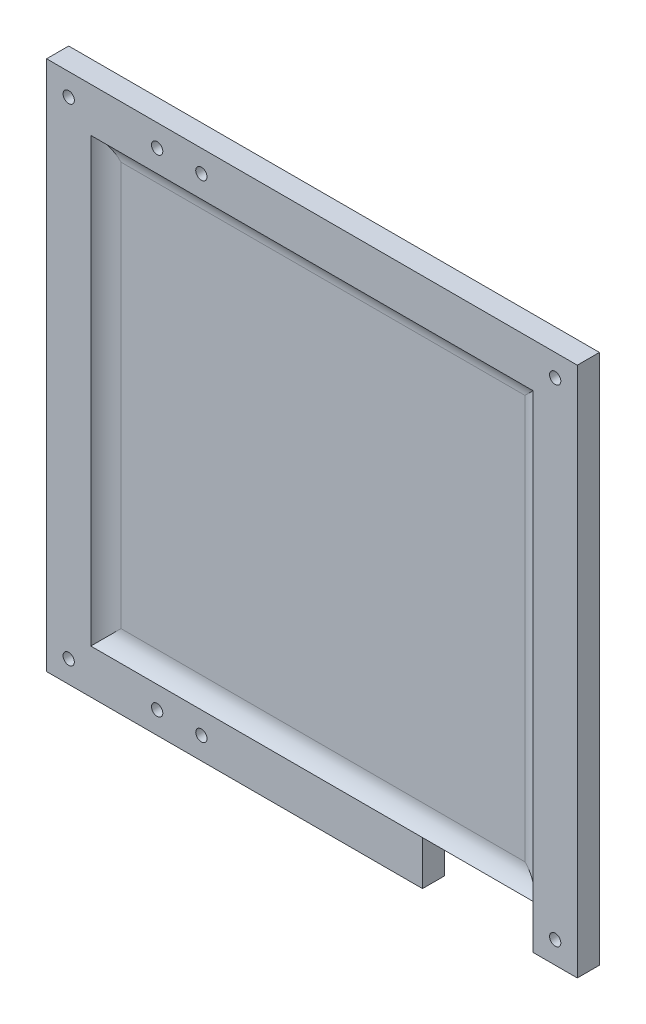
ISO-10303-21;
HEADER;
FILE_DESCRIPTION(('STEP AP214'),'2;1');
FILE_NAME('part.step','',(''),(''),'','','');
FILE_SCHEMA(('AUTOMOTIVE_DESIGN { 1 0 10303 214 1 1 1 1 }'));
ENDSEC;
DATA;
#1=APPLICATION_CONTEXT('core data for automotive mechanical design processes');
#2=APPLICATION_PROTOCOL_DEFINITION('international standard','automotive_design',2000,#1);
#3=PRODUCT_CONTEXT('',#1,'mechanical');
#4=PRODUCT('Part','Part','',(#3));
#5=PRODUCT_RELATED_PRODUCT_CATEGORY('part','',(#4));
#6=PRODUCT_DEFINITION_FORMATION('','',#4);
#7=PRODUCT_DEFINITION_CONTEXT('part definition',#1,'design');
#8=PRODUCT_DEFINITION('design','',#6,#7);
#9=PRODUCT_DEFINITION_SHAPE('','',#8);
#10=(LENGTH_UNIT() NAMED_UNIT(*) SI_UNIT(.MILLI.,.METRE.));
#11=(NAMED_UNIT(*) PLANE_ANGLE_UNIT() SI_UNIT($,.RADIAN.));
#12=(NAMED_UNIT(*) SI_UNIT($,.STERADIAN.) SOLID_ANGLE_UNIT());
#13=UNCERTAINTY_MEASURE_WITH_UNIT(LENGTH_MEASURE(1.E-05),#10,'distance_accuracy_value','');
#14=(GEOMETRIC_REPRESENTATION_CONTEXT(3) GLOBAL_UNCERTAINTY_ASSIGNED_CONTEXT((#13)) GLOBAL_UNIT_ASSIGNED_CONTEXT((#10,
#11,#12)) REPRESENTATION_CONTEXT('',''));
#15=CARTESIAN_POINT('',(0.,0.,0.));
#16=DIRECTION('',(0.,0.,1.));
#17=DIRECTION('',(1.,0.,0.));
#18=AXIS2_PLACEMENT_3D('',#15,#16,#17);
#19=CARTESIAN_POINT('',(-120.,-120.,10.));
#20=DIRECTION('',(0.,1.,0.));
#21=DIRECTION('',(0.,0.,1.));
#22=AXIS2_PLACEMENT_3D('',#19,#20,#21);
#23=PLANE('',#22);
#24=DIRECTION('',(1.,0.,0.));
#25=VECTOR('',#24,1.);
#26=CARTESIAN_POINT('',(-120.,-120.,0.));
#27=LINE('',#26,#25);
#28=CARTESIAN_POINT('',(-120.,-120.,0.));
#29=VERTEX_POINT('',#28);
#30=CARTESIAN_POINT('',(49.9999999999999,-120.,0.));
#31=VERTEX_POINT('',#30);
#32=EDGE_CURVE('E145',#29,#31,#27,.T.);
#33=ORIENTED_EDGE('',*,*,#32,.T.);
#34=DIRECTION('',(0.,0.,1.));
#35=VECTOR('',#34,1.);
#36=CARTESIAN_POINT('',(49.9999999999999,-120.,-140.));
#37=LINE('',#36,#35);
#38=CARTESIAN_POINT('',(49.9999999999999,-120.,10.));
#39=VERTEX_POINT('',#38);
#40=EDGE_CURVE('E128',#31,#39,#37,.T.);
#41=ORIENTED_EDGE('',*,*,#40,.T.);
#42=DIRECTION('',(1.,0.,0.));
#43=VECTOR('',#42,1.);
#44=CARTESIAN_POINT('',(-120.,-120.,10.));
#45=LINE('',#44,#43);
#46=CARTESIAN_POINT('',(-120.,-120.,10.));
#47=VERTEX_POINT('',#46);
#48=EDGE_CURVE('E143',#47,#39,#45,.T.);
#49=ORIENTED_EDGE('',*,*,#48,.F.);
#50=DIRECTION('',(0.,0.,-1.));
#51=VECTOR('',#50,1.);
#52=CARTESIAN_POINT('',(-120.,-120.,10.));
#53=LINE('',#52,#51);
#54=EDGE_CURVE('E162',#47,#29,#53,.T.);
#55=ORIENTED_EDGE('',*,*,#54,.T.);
#56=EDGE_LOOP('',(#33,#41,#49,#55));
#57=FACE_BOUND('',#56,.T.);
#58=ADVANCED_FACE('F39',(#57),#23,.F.);
#59=CARTESIAN_POINT('',(0.,0.,10.));
#60=DIRECTION('',(0.,0.,-1.));
#61=DIRECTION('',(-1.,0.,0.));
#62=AXIS2_PLACEMENT_3D('',#59,#60,#61);
#63=PLANE('',#62);
#64=ORIENTED_EDGE('',*,*,#48,.T.);
#65=DIRECTION('',(0.,-1.,0.));
#66=VECTOR('',#65,1.);
#67=CARTESIAN_POINT('',(49.9999999999999,-120.,10.));
#68=LINE('',#67,#66);
#69=CARTESIAN_POINT('',(49.9999999999999,-100.,10.));
#70=VERTEX_POINT('',#69);
#71=EDGE_CURVE('E125',#70,#39,#68,.T.);
#72=ORIENTED_EDGE('',*,*,#71,.F.);
#73=DIRECTION('',(1.,0.,0.));
#74=VECTOR('',#73,1.);
#75=CARTESIAN_POINT('',(-99.9999999999999,-100.,10.));
#76=LINE('',#75,#74);
#77=CARTESIAN_POINT('',(-99.9999999999999,-100.,10.));
#78=VERTEX_POINT('',#77);
#79=EDGE_CURVE('E215',#78,#70,#76,.T.);
#80=ORIENTED_EDGE('',*,*,#79,.F.);
#81=DIRECTION('',(0.,-1.,0.));
#82=VECTOR('',#81,1.);
#83=CARTESIAN_POINT('',(-100.,99.9999999999999,10.));
#84=LINE('',#83,#82);
#85=CARTESIAN_POINT('',(-100.,99.9999999999999,10.));
#86=VERTEX_POINT('',#85);
#87=EDGE_CURVE('E230',#86,#78,#84,.T.);
#88=ORIENTED_EDGE('',*,*,#87,.F.);
#89=DIRECTION('',(-1.,0.,0.));
#90=VECTOR('',#89,1.);
#91=CARTESIAN_POINT('',(100.,99.9999999999999,10.));
#92=LINE('',#91,#90);
#93=CARTESIAN_POINT('',(100.,99.9999999999999,10.));
#94=VERTEX_POINT('',#93);
#95=EDGE_CURVE('E223',#94,#86,#92,.T.);
#96=ORIENTED_EDGE('',*,*,#95,.F.);
#97=DIRECTION('',(0.,1.,0.));
#98=VECTOR('',#97,1.);
#99=CARTESIAN_POINT('',(99.9999999999999,-100.,10.));
#100=LINE('',#99,#98);
#101=CARTESIAN_POINT('',(99.9999999999999,-100.,10.));
#102=VERTEX_POINT('',#101);
#103=EDGE_CURVE('E218',#102,#94,#100,.T.);
#104=ORIENTED_EDGE('',*,*,#103,.F.);
#105=DIRECTION('',(0.,1.,0.));
#106=VECTOR('',#105,1.);
#107=CARTESIAN_POINT('',(99.9999999999999,-120.,10.));
#108=LINE('',#107,#106);
#109=CARTESIAN_POINT('',(99.9999999999999,-120.,10.));
#110=VERTEX_POINT('',#109);
#111=EDGE_CURVE('E137',#110,#102,#108,.T.);
#112=ORIENTED_EDGE('',*,*,#111,.F.);
#113=CARTESIAN_POINT('',(120.,-120.,10.));
#114=VERTEX_POINT('',#113);
#115=EDGE_CURVE('E157',#110,#114,#45,.T.);
#116=ORIENTED_EDGE('',*,*,#115,.T.);
#117=DIRECTION('',(0.,1.,0.));
#118=VECTOR('',#117,1.);
#119=CARTESIAN_POINT('',(120.,-120.,10.));
#120=LINE('',#119,#118);
#121=CARTESIAN_POINT('',(120.,120.,10.));
#122=VERTEX_POINT('',#121);
#123=EDGE_CURVE('E180',#114,#122,#120,.T.);
#124=ORIENTED_EDGE('',*,*,#123,.T.);
#125=DIRECTION('',(-1.,0.,0.));
#126=VECTOR('',#125,1.);
#127=CARTESIAN_POINT('',(-120.,120.,10.));
#128=LINE('',#127,#126);
#129=CARTESIAN_POINT('',(-120.,120.,10.));
#130=VERTEX_POINT('',#129);
#131=EDGE_CURVE('E299',#122,#130,#128,.T.);
#132=ORIENTED_EDGE('',*,*,#131,.T.);
#133=DIRECTION('',(0.,-1.,0.));
#134=VECTOR('',#133,1.);
#135=CARTESIAN_POINT('',(-120.,-120.,10.));
#136=LINE('',#135,#134);
#137=EDGE_CURVE('E153',#130,#47,#136,.T.);
#138=ORIENTED_EDGE('',*,*,#137,.T.);
#139=EDGE_LOOP('',(#64,#72,#80,#88,#96,#104,#112,#116,#124,#132,#138));
#140=FACE_BOUND('',#139,.T.);
#141=CARTESIAN_POINT('',(-110.,110.,10.));
#142=DIRECTION('',(0.,0.,1.));
#143=DIRECTION('',(1.,0.,0.));
#144=AXIS2_PLACEMENT_3D('',#141,#142,#143);
#145=CIRCLE('',#144,2.54999999999999);
#146=CARTESIAN_POINT('',(-107.45,110.,10.));
#147=VERTEX_POINT('',#146);
#148=EDGE_CURVE('E172',#147,#147,#145,.T.);
#149=ORIENTED_EDGE('',*,*,#148,.F.);
#150=EDGE_LOOP('',(#149));
#151=FACE_BOUND('',#150,.T.);
#152=CARTESIAN_POINT('',(110.,110.,10.));
#153=DIRECTION('',(0.,0.,1.));
#154=DIRECTION('',(-1.,0.,0.));
#155=AXIS2_PLACEMENT_3D('',#152,#153,#154);
#156=CIRCLE('',#155,2.54999999999999);
#157=CARTESIAN_POINT('',(107.45,110.,10.));
#158=VERTEX_POINT('',#157);
#159=EDGE_CURVE('E283',#158,#158,#156,.T.);
#160=ORIENTED_EDGE('',*,*,#159,.F.);
#161=EDGE_LOOP('',(#160));
#162=FACE_BOUND('',#161,.T.);
#163=CARTESIAN_POINT('',(110.,-110.,10.));
#164=DIRECTION('',(0.,0.,1.));
#165=DIRECTION('',(1.,0.,0.));
#166=AXIS2_PLACEMENT_3D('',#163,#164,#165);
#167=CIRCLE('',#166,2.54999999999999);
#168=CARTESIAN_POINT('',(112.55,-110.,10.));
#169=VERTEX_POINT('',#168);
#170=EDGE_CURVE('E275',#169,#169,#167,.T.);
#171=ORIENTED_EDGE('',*,*,#170,.F.);
#172=EDGE_LOOP('',(#171));
#173=FACE_BOUND('',#172,.T.);
#174=CARTESIAN_POINT('',(-110.,-110.,10.));
#175=DIRECTION('',(0.,0.,1.));
#176=DIRECTION('',(-1.,0.,0.));
#177=AXIS2_PLACEMENT_3D('',#174,#175,#176);
#178=CIRCLE('',#177,2.54999999999999);
#179=CARTESIAN_POINT('',(-112.55,-110.,10.));
#180=VERTEX_POINT('',#179);
#181=EDGE_CURVE('E267',#180,#180,#178,.T.);
#182=ORIENTED_EDGE('',*,*,#181,.F.);
#183=EDGE_LOOP('',(#182));
#184=FACE_BOUND('',#183,.T.);
#185=CARTESIAN_POINT('',(-69.9999999999999,110.,10.));
#186=DIRECTION('',(0.,0.,1.));
#187=DIRECTION('',(1.,0.,0.));
#188=AXIS2_PLACEMENT_3D('',#185,#186,#187);
#189=CIRCLE('',#188,2.54999999999999);
#190=CARTESIAN_POINT('',(-67.4499999999999,110.,10.));
#191=VERTEX_POINT('',#190);
#192=EDGE_CURVE('E259',#191,#191,#189,.T.);
#193=ORIENTED_EDGE('',*,*,#192,.F.);
#194=EDGE_LOOP('',(#193));
#195=FACE_BOUND('',#194,.T.);
#196=CARTESIAN_POINT('',(-69.9999999999999,-110.,10.));
#197=DIRECTION('',(0.,0.,1.));
#198=DIRECTION('',(-1.,0.,0.));
#199=AXIS2_PLACEMENT_3D('',#196,#197,#198);
#200=CIRCLE('',#199,2.54999999999999);
#201=CARTESIAN_POINT('',(-72.5499999999999,-110.,10.));
#202=VERTEX_POINT('',#201);
#203=EDGE_CURVE('E251',#202,#202,#200,.T.);
#204=ORIENTED_EDGE('',*,*,#203,.F.);
#205=EDGE_LOOP('',(#204));
#206=FACE_BOUND('',#205,.T.);
#207=CARTESIAN_POINT('',(-49.9999999999999,110.,10.));
#208=DIRECTION('',(0.,0.,1.));
#209=DIRECTION('',(1.,0.,0.));
#210=AXIS2_PLACEMENT_3D('',#207,#208,#209);
#211=CIRCLE('',#210,2.55);
#212=CARTESIAN_POINT('',(-47.4499999999999,110.,10.));
#213=VERTEX_POINT('',#212);
#214=EDGE_CURVE('E243',#213,#213,#211,.T.);
#215=ORIENTED_EDGE('',*,*,#214,.F.);
#216=EDGE_LOOP('',(#215));
#217=FACE_BOUND('',#216,.T.);
#218=CARTESIAN_POINT('',(-49.9999999999999,-110.,10.));
#219=DIRECTION('',(0.,0.,1.));
#220=DIRECTION('',(-1.,0.,0.));
#221=AXIS2_PLACEMENT_3D('',#218,#219,#220);
#222=CIRCLE('',#221,2.55);
#223=CARTESIAN_POINT('',(-52.5499999999999,-110.,10.));
#224=VERTEX_POINT('',#223);
#225=EDGE_CURVE('E235',#224,#224,#222,.T.);
#226=ORIENTED_EDGE('',*,*,#225,.F.);
#227=EDGE_LOOP('',(#226));
#228=FACE_BOUND('',#227,.T.);
#229=ADVANCED_FACE('F150',(#140,#151,#162,#173,#184,#195,#206,#217,#228),#63,.F.);
#230=CARTESIAN_POINT('',(0.,0.,0.));
#231=DIRECTION('',(0.,0.,-1.));
#232=DIRECTION('',(-1.,0.,0.));
#233=AXIS2_PLACEMENT_3D('',#230,#231,#232);
#234=PLANE('',#233);
#235=DIRECTION('',(0.,1.,0.));
#236=VECTOR('',#235,1.);
#237=CARTESIAN_POINT('',(49.9999999999999,0.,0.));
#238=LINE('',#237,#236);
#239=CARTESIAN_POINT('',(49.9999999999999,-100.,0.));
#240=VERTEX_POINT('',#239);
#241=EDGE_CURVE('E203',#31,#240,#238,.T.);
#242=ORIENTED_EDGE('',*,*,#241,.F.);
#243=ORIENTED_EDGE('',*,*,#32,.F.);
#244=DIRECTION('',(0.,-1.,0.));
#245=VECTOR('',#244,1.);
#246=CARTESIAN_POINT('',(-120.,-120.,0.));
#247=LINE('',#246,#245);
#248=CARTESIAN_POINT('',(-120.,120.,0.));
#249=VERTEX_POINT('',#248);
#250=EDGE_CURVE('E175',#249,#29,#247,.T.);
#251=ORIENTED_EDGE('',*,*,#250,.F.);
#252=DIRECTION('',(-1.,0.,0.));
#253=VECTOR('',#252,1.);
#254=CARTESIAN_POINT('',(-120.,120.,0.));
#255=LINE('',#254,#253);
#256=CARTESIAN_POINT('',(120.,120.,0.));
#257=VERTEX_POINT('',#256);
#258=EDGE_CURVE('E171',#257,#249,#255,.T.);
#259=ORIENTED_EDGE('',*,*,#258,.F.);
#260=DIRECTION('',(0.,1.,0.));
#261=VECTOR('',#260,1.);
#262=CARTESIAN_POINT('',(120.,-120.,0.));
#263=LINE('',#262,#261);
#264=CARTESIAN_POINT('',(120.,-120.,0.));
#265=VERTEX_POINT('',#264);
#266=EDGE_CURVE('E167',#265,#257,#263,.T.);
#267=ORIENTED_EDGE('',*,*,#266,.F.);
#268=CARTESIAN_POINT('',(99.9999999999999,-120.,0.));
#269=VERTEX_POINT('',#268);
#270=EDGE_CURVE('E178',#269,#265,#27,.T.);
#271=ORIENTED_EDGE('',*,*,#270,.F.);
#272=DIRECTION('',(0.,-1.,0.));
#273=VECTOR('',#272,1.);
#274=CARTESIAN_POINT('',(99.9999999999999,0.,0.));
#275=LINE('',#274,#273);
#276=CARTESIAN_POINT('',(99.9999999999999,-100.,0.));
#277=VERTEX_POINT('',#276);
#278=EDGE_CURVE('E317',#277,#269,#275,.T.);
#279=ORIENTED_EDGE('',*,*,#278,.F.);
#280=DIRECTION('',(1.,0.,0.));
#281=VECTOR('',#280,1.);
#282=CARTESIAN_POINT('',(0.,-100.,0.));
#283=LINE('',#282,#281);
#284=EDGE_CURVE('E315',#240,#277,#283,.T.);
#285=ORIENTED_EDGE('',*,*,#284,.F.);
#286=EDGE_LOOP('',(#242,#243,#251,#259,#267,#271,#279,#285));
#287=FACE_BOUND('',#286,.T.);
#288=CARTESIAN_POINT('',(-49.9999999999999,110.,0.));
#289=DIRECTION('',(0.,0.,1.));
#290=DIRECTION('',(1.,0.,0.));
#291=AXIS2_PLACEMENT_3D('',#288,#289,#290);
#292=CIRCLE('',#291,2.55);
#293=CARTESIAN_POINT('',(-47.4499999999999,110.,0.));
#294=VERTEX_POINT('',#293);
#295=EDGE_CURVE('E239',#294,#294,#292,.T.);
#296=ORIENTED_EDGE('',*,*,#295,.T.);
#297=EDGE_LOOP('',(#296));
#298=FACE_BOUND('',#297,.T.);
#299=CARTESIAN_POINT('',(-69.9999999999999,110.,0.));
#300=DIRECTION('',(0.,0.,1.));
#301=DIRECTION('',(1.,0.,0.));
#302=AXIS2_PLACEMENT_3D('',#299,#300,#301);
#303=CIRCLE('',#302,2.54999999999999);
#304=CARTESIAN_POINT('',(-67.4499999999999,110.,0.));
#305=VERTEX_POINT('',#304);
#306=EDGE_CURVE('E255',#305,#305,#303,.T.);
#307=ORIENTED_EDGE('',*,*,#306,.T.);
#308=EDGE_LOOP('',(#307));
#309=FACE_BOUND('',#308,.T.);
#310=CARTESIAN_POINT('',(110.,-110.,0.));
#311=DIRECTION('',(0.,0.,1.));
#312=DIRECTION('',(1.,0.,0.));
#313=AXIS2_PLACEMENT_3D('',#310,#311,#312);
#314=CIRCLE('',#313,2.54999999999999);
#315=CARTESIAN_POINT('',(112.55,-110.,0.));
#316=VERTEX_POINT('',#315);
#317=EDGE_CURVE('E271',#316,#316,#314,.T.);
#318=ORIENTED_EDGE('',*,*,#317,.T.);
#319=EDGE_LOOP('',(#318));
#320=FACE_BOUND('',#319,.T.);
#321=CARTESIAN_POINT('',(-110.,110.,0.));
#322=DIRECTION('',(0.,0.,1.));
#323=DIRECTION('',(1.,0.,0.));
#324=AXIS2_PLACEMENT_3D('',#321,#322,#323);
#325=CIRCLE('',#324,2.54999999999999);
#326=CARTESIAN_POINT('',(-107.45,110.,0.));
#327=VERTEX_POINT('',#326);
#328=EDGE_CURVE('E287',#327,#327,#325,.T.);
#329=ORIENTED_EDGE('',*,*,#328,.T.);
#330=EDGE_LOOP('',(#329));
#331=FACE_BOUND('',#330,.T.);
#332=CARTESIAN_POINT('',(110.,110.,0.));
#333=DIRECTION('',(0.,0.,1.));
#334=DIRECTION('',(-1.,0.,0.));
#335=AXIS2_PLACEMENT_3D('',#332,#333,#334);
#336=CIRCLE('',#335,2.54999999999999);
#337=CARTESIAN_POINT('',(107.45,110.,0.));
#338=VERTEX_POINT('',#337);
#339=EDGE_CURVE('E279',#338,#338,#336,.T.);
#340=ORIENTED_EDGE('',*,*,#339,.T.);
#341=EDGE_LOOP('',(#340));
#342=FACE_BOUND('',#341,.T.);
#343=CARTESIAN_POINT('',(-110.,-110.,0.));
#344=DIRECTION('',(0.,0.,1.));
#345=DIRECTION('',(-1.,0.,0.));
#346=AXIS2_PLACEMENT_3D('',#343,#344,#345);
#347=CIRCLE('',#346,2.54999999999999);
#348=CARTESIAN_POINT('',(-112.55,-110.,0.));
#349=VERTEX_POINT('',#348);
#350=EDGE_CURVE('E263',#349,#349,#347,.T.);
#351=ORIENTED_EDGE('',*,*,#350,.T.);
#352=EDGE_LOOP('',(#351));
#353=FACE_BOUND('',#352,.T.);
#354=CARTESIAN_POINT('',(-69.9999999999999,-110.,0.));
#355=DIRECTION('',(0.,0.,1.));
#356=DIRECTION('',(-1.,0.,0.));
#357=AXIS2_PLACEMENT_3D('',#354,#355,#356);
#358=CIRCLE('',#357,2.54999999999999);
#359=CARTESIAN_POINT('',(-72.5499999999999,-110.,0.));
#360=VERTEX_POINT('',#359);
#361=EDGE_CURVE('E247',#360,#360,#358,.T.);
#362=ORIENTED_EDGE('',*,*,#361,.T.);
#363=EDGE_LOOP('',(#362));
#364=FACE_BOUND('',#363,.T.);
#365=CARTESIAN_POINT('',(-49.9999999999999,-110.,0.));
#366=DIRECTION('',(0.,0.,1.));
#367=DIRECTION('',(-1.,0.,0.));
#368=AXIS2_PLACEMENT_3D('',#365,#366,#367);
#369=CIRCLE('',#368,2.55);
#370=CARTESIAN_POINT('',(-52.5499999999999,-110.,0.));
#371=VERTEX_POINT('',#370);
#372=EDGE_CURVE('E234',#371,#371,#369,.T.);
#373=ORIENTED_EDGE('',*,*,#372,.T.);
#374=EDGE_LOOP('',(#373));
#375=FACE_BOUND('',#374,.T.);
#376=ADVANCED_FACE('F311',(#287,#298,#309,#320,#331,#342,#353,#364,#375),#234,.T.);
#377=CARTESIAN_POINT('',(120.,-120.,10.));
#378=DIRECTION('',(-1.,0.,0.));
#379=DIRECTION('',(0.,-1.,0.));
#380=AXIS2_PLACEMENT_3D('',#377,#378,#379);
#381=PLANE('',#380);
#382=ORIENTED_EDGE('',*,*,#266,.T.);
#383=DIRECTION('',(0.,0.,-1.));
#384=VECTOR('',#383,1.);
#385=CARTESIAN_POINT('',(120.,120.,10.));
#386=LINE('',#385,#384);
#387=EDGE_CURVE('E188',#122,#257,#386,.T.);
#388=ORIENTED_EDGE('',*,*,#387,.F.);
#389=ORIENTED_EDGE('',*,*,#123,.F.);
#390=DIRECTION('',(0.,0.,-1.));
#391=VECTOR('',#390,1.);
#392=CARTESIAN_POINT('',(120.,-120.,10.));
#393=LINE('',#392,#391);
#394=EDGE_CURVE('E156',#114,#265,#393,.T.);
#395=ORIENTED_EDGE('',*,*,#394,.T.);
#396=EDGE_LOOP('',(#382,#388,#389,#395));
#397=FACE_BOUND('',#396,.T.);
#398=ADVANCED_FACE('F384',(#397),#381,.F.);
#399=CARTESIAN_POINT('',(-120.,120.,10.));
#400=DIRECTION('',(0.,-1.,0.));
#401=DIRECTION('',(1.,0.,0.));
#402=AXIS2_PLACEMENT_3D('',#399,#400,#401);
#403=PLANE('',#402);
#404=ORIENTED_EDGE('',*,*,#258,.T.);
#405=DIRECTION('',(0.,0.,-1.));
#406=VECTOR('',#405,1.);
#407=CARTESIAN_POINT('',(-120.,120.,10.));
#408=LINE('',#407,#406);
#409=EDGE_CURVE('E184',#130,#249,#408,.T.);
#410=ORIENTED_EDGE('',*,*,#409,.F.);
#411=ORIENTED_EDGE('',*,*,#131,.F.);
#412=ORIENTED_EDGE('',*,*,#387,.T.);
#413=EDGE_LOOP('',(#404,#410,#411,#412));
#414=FACE_BOUND('',#413,.T.);
#415=ADVANCED_FACE('F306',(#414),#403,.F.);
#416=CARTESIAN_POINT('',(-120.,-120.,10.));
#417=DIRECTION('',(1.,0.,0.));
#418=DIRECTION('',(0.,1.,0.));
#419=AXIS2_PLACEMENT_3D('',#416,#417,#418);
#420=PLANE('',#419);
#421=ORIENTED_EDGE('',*,*,#250,.T.);
#422=ORIENTED_EDGE('',*,*,#54,.F.);
#423=ORIENTED_EDGE('',*,*,#137,.F.);
#424=ORIENTED_EDGE('',*,*,#409,.T.);
#425=EDGE_LOOP('',(#421,#422,#423,#424));
#426=FACE_BOUND('',#425,.T.);
#427=ADVANCED_FACE('F309',(#426),#420,.F.);
#428=ORIENTED_EDGE('',*,*,#115,.F.);
#429=DIRECTION('',(0.,0.,1.));
#430=VECTOR('',#429,1.);
#431=CARTESIAN_POINT('',(99.9999999999999,-120.,-140.));
#432=LINE('',#431,#430);
#433=EDGE_CURVE('E147',#269,#110,#432,.T.);
#434=ORIENTED_EDGE('',*,*,#433,.F.);
#435=ORIENTED_EDGE('',*,*,#270,.T.);
#436=ORIENTED_EDGE('',*,*,#394,.F.);
#437=EDGE_LOOP('',(#428,#434,#435,#436));
#438=FACE_BOUND('',#437,.T.);
#439=ADVANCED_FACE('F363',(#438),#23,.F.);
#440=CARTESIAN_POINT('',(-110.,110.,10.));
#441=DIRECTION('',(0.,0.,-1.));
#442=DIRECTION('',(-1.,0.,0.));
#443=AXIS2_PLACEMENT_3D('',#440,#441,#442);
#444=CYLINDRICAL_SURFACE('',#443,2.54999999999999);
#445=ORIENTED_EDGE('',*,*,#148,.T.);
#446=EDGE_LOOP('',(#445));
#447=FACE_BOUND('',#446,.T.);
#448=ORIENTED_EDGE('',*,*,#328,.F.);
#449=EDGE_LOOP('',(#448));
#450=FACE_BOUND('',#449,.T.);
#451=ADVANCED_FACE('F371',(#447,#450),#444,.F.);
#452=CARTESIAN_POINT('',(110.,110.,10.));
#453=DIRECTION('',(0.,0.,-1.));
#454=DIRECTION('',(-1.,0.,0.));
#455=AXIS2_PLACEMENT_3D('',#452,#453,#454);
#456=CYLINDRICAL_SURFACE('',#455,2.54999999999999);
#457=ORIENTED_EDGE('',*,*,#159,.T.);
#458=EDGE_LOOP('',(#457));
#459=FACE_BOUND('',#458,.T.);
#460=ORIENTED_EDGE('',*,*,#339,.F.);
#461=EDGE_LOOP('',(#460));
#462=FACE_BOUND('',#461,.T.);
#463=ADVANCED_FACE('F377',(#459,#462),#456,.F.);
#464=CARTESIAN_POINT('',(110.,-110.,10.));
#465=DIRECTION('',(0.,0.,-1.));
#466=DIRECTION('',(-1.,0.,0.));
#467=AXIS2_PLACEMENT_3D('',#464,#465,#466);
#468=CYLINDRICAL_SURFACE('',#467,2.54999999999999);
#469=ORIENTED_EDGE('',*,*,#170,.T.);
#470=EDGE_LOOP('',(#469));
#471=FACE_BOUND('',#470,.T.);
#472=ORIENTED_EDGE('',*,*,#317,.F.);
#473=EDGE_LOOP('',(#472));
#474=FACE_BOUND('',#473,.T.);
#475=ADVANCED_FACE('F492',(#471,#474),#468,.F.);
#476=CARTESIAN_POINT('',(-110.,-110.,10.));
#477=DIRECTION('',(0.,0.,-1.));
#478=DIRECTION('',(-1.,0.,0.));
#479=AXIS2_PLACEMENT_3D('',#476,#477,#478);
#480=CYLINDRICAL_SURFACE('',#479,2.54999999999999);
#481=ORIENTED_EDGE('',*,*,#181,.T.);
#482=EDGE_LOOP('',(#481));
#483=FACE_BOUND('',#482,.T.);
#484=ORIENTED_EDGE('',*,*,#350,.F.);
#485=EDGE_LOOP('',(#484));
#486=FACE_BOUND('',#485,.T.);
#487=ADVANCED_FACE('F483',(#483,#486),#480,.F.);
#488=CARTESIAN_POINT('',(-69.9999999999999,110.,10.));
#489=DIRECTION('',(0.,0.,-1.));
#490=DIRECTION('',(-1.,0.,0.));
#491=AXIS2_PLACEMENT_3D('',#488,#489,#490);
#492=CYLINDRICAL_SURFACE('',#491,2.54999999999999);
#493=ORIENTED_EDGE('',*,*,#192,.T.);
#494=EDGE_LOOP('',(#493));
#495=FACE_BOUND('',#494,.T.);
#496=ORIENTED_EDGE('',*,*,#306,.F.);
#497=EDGE_LOOP('',(#496));
#498=FACE_BOUND('',#497,.T.);
#499=ADVANCED_FACE('F474',(#495,#498),#492,.F.);
#500=CARTESIAN_POINT('',(-69.9999999999999,-110.,10.));
#501=DIRECTION('',(0.,0.,-1.));
#502=DIRECTION('',(-1.,0.,0.));
#503=AXIS2_PLACEMENT_3D('',#500,#501,#502);
#504=CYLINDRICAL_SURFACE('',#503,2.54999999999999);
#505=ORIENTED_EDGE('',*,*,#203,.T.);
#506=EDGE_LOOP('',(#505));
#507=FACE_BOUND('',#506,.T.);
#508=ORIENTED_EDGE('',*,*,#361,.F.);
#509=EDGE_LOOP('',(#508));
#510=FACE_BOUND('',#509,.T.);
#511=ADVANCED_FACE('F465',(#507,#510),#504,.F.);
#512=CARTESIAN_POINT('',(-49.9999999999999,110.,10.));
#513=DIRECTION('',(0.,0.,-1.));
#514=DIRECTION('',(-1.,0.,0.));
#515=AXIS2_PLACEMENT_3D('',#512,#513,#514);
#516=CYLINDRICAL_SURFACE('',#515,2.55);
#517=ORIENTED_EDGE('',*,*,#214,.T.);
#518=EDGE_LOOP('',(#517));
#519=FACE_BOUND('',#518,.T.);
#520=ORIENTED_EDGE('',*,*,#295,.F.);
#521=EDGE_LOOP('',(#520));
#522=FACE_BOUND('',#521,.T.);
#523=ADVANCED_FACE('F357',(#519,#522),#516,.F.);
#524=CARTESIAN_POINT('',(-49.9999999999999,-110.,10.));
#525=DIRECTION('',(0.,0.,-1.));
#526=DIRECTION('',(-1.,0.,0.));
#527=AXIS2_PLACEMENT_3D('',#524,#525,#526);
#528=CYLINDRICAL_SURFACE('',#527,2.55);
#529=ORIENTED_EDGE('',*,*,#225,.T.);
#530=EDGE_LOOP('',(#529));
#531=FACE_BOUND('',#530,.T.);
#532=ORIENTED_EDGE('',*,*,#372,.F.);
#533=EDGE_LOOP('',(#532));
#534=FACE_BOUND('',#533,.T.);
#535=ADVANCED_FACE('F350',(#531,#534),#528,.F.);
#536=CARTESIAN_POINT('',(0.,0.,5.));
#537=DIRECTION('',(0.,0.,1.));
#538=DIRECTION('',(1.,0.,0.));
#539=AXIS2_PLACEMENT_3D('',#536,#537,#538);
#540=PLANE('',#539);
#541=DIRECTION('',(-1.,0.,0.));
#542=VECTOR('',#541,1.);
#543=CARTESIAN_POINT('',(99.9999999999999,-91.3397459621556,5.));
#544=LINE('',#543,#542);
#545=CARTESIAN_POINT('',(-91.3397459621555,-91.3397459621556,5.));
#546=VERTEX_POINT('',#545);
#547=CARTESIAN_POINT('',(91.3397459621555,-91.3397459621556,5.));
#548=VERTEX_POINT('',#547);
#549=EDGE_CURVE('E49',#546,#548,#544,.F.);
#550=ORIENTED_EDGE('',*,*,#549,.T.);
#551=DIRECTION('',(0.,-1.,0.));
#552=VECTOR('',#551,1.);
#553=CARTESIAN_POINT('',(91.3397459621556,99.9999999999999,5.));
#554=LINE('',#553,#552);
#555=CARTESIAN_POINT('',(91.3397459621556,91.3397459621555,5.));
#556=VERTEX_POINT('',#555);
#557=EDGE_CURVE('E11',#548,#556,#554,.F.);
#558=ORIENTED_EDGE('',*,*,#557,.T.);
#559=DIRECTION('',(1.,0.,0.));
#560=VECTOR('',#559,1.);
#561=CARTESIAN_POINT('',(-100.,91.3397459621555,5.));
#562=LINE('',#561,#560);
#563=CARTESIAN_POINT('',(-91.3397459621556,91.3397459621555,5.));
#564=VERTEX_POINT('',#563);
#565=EDGE_CURVE('E192',#556,#564,#562,.F.);
#566=ORIENTED_EDGE('',*,*,#565,.T.);
#567=DIRECTION('',(0.,1.,0.));
#568=VECTOR('',#567,1.);
#569=CARTESIAN_POINT('',(-91.3397459621555,-100.,5.));
#570=LINE('',#569,#568);
#571=EDGE_CURVE('E60',#564,#546,#570,.F.);
#572=ORIENTED_EDGE('',*,*,#571,.T.);
#573=EDGE_LOOP('',(#550,#558,#566,#572));
#574=FACE_BOUND('',#573,.T.);
#575=ADVANCED_FACE('F348',(#574),#540,.T.);
#576=CARTESIAN_POINT('',(-91.3397459621556,99.9999999999999,15.));
#577=DIRECTION('',(0.,-1.,0.));
#578=DIRECTION('',(1.,0.,0.));
#579=AXIS2_PLACEMENT_3D('',#576,#577,#578);
#580=CYLINDRICAL_SURFACE('',#579,10.);
#581=CARTESIAN_POINT('',(-91.3397459621556,91.3397459621555,15.));
#582=DIRECTION('',(-0.707106781186547,-0.707106781186548,0.));
#583=DIRECTION('',(0.707106781186548,-0.707106781186547,0.));
#584=AXIS2_PLACEMENT_3D('',#581,#582,#583);
#585=ELLIPSE('',#584,14.142135623731,10.);
#586=EDGE_CURVE('E206',#86,#564,#585,.T.);
#587=ORIENTED_EDGE('',*,*,#586,.F.);
#588=ORIENTED_EDGE('',*,*,#87,.T.);
#589=CARTESIAN_POINT('',(-91.3397459621555,-91.3397459621556,15.));
#590=DIRECTION('',(0.707106781186548,-0.707106781186547,0.));
#591=DIRECTION('',(0.707106781186547,0.707106781186548,0.));
#592=AXIS2_PLACEMENT_3D('',#589,#590,#591);
#593=ELLIPSE('',#592,14.1421356237309,10.);
#594=EDGE_CURVE('E43',#546,#78,#593,.F.);
#595=ORIENTED_EDGE('',*,*,#594,.F.);
#596=ORIENTED_EDGE('',*,*,#571,.F.);
#597=EDGE_LOOP('',(#587,#588,#595,#596));
#598=FACE_BOUND('',#597,.T.);
#599=ADVANCED_FACE('F41',(#598),#580,.F.);
#600=CARTESIAN_POINT('',(-99.9999999999999,-91.3397459621556,15.));
#601=DIRECTION('',(1.,0.,0.));
#602=DIRECTION('',(0.,0.,-1.));
#603=AXIS2_PLACEMENT_3D('',#600,#601,#602);
#604=CYLINDRICAL_SURFACE('',#603,10.);
#605=ORIENTED_EDGE('',*,*,#594,.T.);
#606=ORIENTED_EDGE('',*,*,#79,.T.);
#607=DIRECTION('',(-1.,0.,0.));
#608=VECTOR('',#607,1.);
#609=CARTESIAN_POINT('',(49.9999999999999,-100.,10.));
#610=LINE('',#609,#608);
#611=EDGE_CURVE('E148',#102,#70,#610,.T.);
#612=ORIENTED_EDGE('',*,*,#611,.F.);
#613=CARTESIAN_POINT('',(91.3397459621555,-91.3397459621556,15.));
#614=DIRECTION('',(0.707106781186548,0.707106781186547,0.));
#615=DIRECTION('',(-0.707106781186547,0.707106781186548,0.));
#616=AXIS2_PLACEMENT_3D('',#613,#614,#615);
#617=ELLIPSE('',#616,14.1421356237309,10.);
#618=EDGE_CURVE('E202',#548,#102,#617,.F.);
#619=ORIENTED_EDGE('',*,*,#618,.F.);
#620=ORIENTED_EDGE('',*,*,#549,.F.);
#621=EDGE_LOOP('',(#605,#606,#612,#619,#620));
#622=FACE_BOUND('',#621,.T.);
#623=ADVANCED_FACE('F342',(#622),#604,.F.);
#624=CARTESIAN_POINT('',(100.,91.3397459621555,15.));
#625=DIRECTION('',(-1.,0.,0.));
#626=DIRECTION('',(0.,-1.,0.));
#627=AXIS2_PLACEMENT_3D('',#624,#625,#626);
#628=CYLINDRICAL_SURFACE('',#627,10.);
#629=ORIENTED_EDGE('',*,*,#586,.T.);
#630=ORIENTED_EDGE('',*,*,#565,.F.);
#631=CARTESIAN_POINT('',(91.3397459621556,91.3397459621555,15.));
#632=DIRECTION('',(-0.707106781186547,0.707106781186547,0.));
#633=DIRECTION('',(0.707106781186547,0.707106781186547,0.));
#634=AXIS2_PLACEMENT_3D('',#631,#632,#633);
#635=ELLIPSE('',#634,14.142135623731,10.);
#636=EDGE_CURVE('E199',#94,#556,#635,.T.);
#637=ORIENTED_EDGE('',*,*,#636,.F.);
#638=ORIENTED_EDGE('',*,*,#95,.T.);
#639=EDGE_LOOP('',(#629,#630,#637,#638));
#640=FACE_BOUND('',#639,.T.);
#641=ADVANCED_FACE('F347',(#640),#628,.F.);
#642=CARTESIAN_POINT('',(91.3397459621555,-100.,15.));
#643=DIRECTION('',(0.,1.,0.));
#644=DIRECTION('',(-1.,0.,0.));
#645=AXIS2_PLACEMENT_3D('',#642,#643,#644);
#646=CYLINDRICAL_SURFACE('',#645,10.);
#647=ORIENTED_EDGE('',*,*,#618,.T.);
#648=ORIENTED_EDGE('',*,*,#103,.T.);
#649=ORIENTED_EDGE('',*,*,#636,.T.);
#650=ORIENTED_EDGE('',*,*,#557,.F.);
#651=EDGE_LOOP('',(#647,#648,#649,#650));
#652=FACE_BOUND('',#651,.T.);
#653=ADVANCED_FACE('F345',(#652),#646,.F.);
#654=CARTESIAN_POINT('',(49.9999999999999,-120.,-140.));
#655=DIRECTION('',(-1.,0.,0.));
#656=DIRECTION('',(0.,0.,1.));
#657=AXIS2_PLACEMENT_3D('',#654,#655,#656);
#658=PLANE('',#657);
#659=ORIENTED_EDGE('',*,*,#241,.T.);
#660=DIRECTION('',(0.,0.,1.));
#661=VECTOR('',#660,1.);
#662=CARTESIAN_POINT('',(49.9999999999999,-100.,-140.));
#663=LINE('',#662,#661);
#664=EDGE_CURVE('E131',#240,#70,#663,.T.);
#665=ORIENTED_EDGE('',*,*,#664,.T.);
#666=ORIENTED_EDGE('',*,*,#71,.T.);
#667=ORIENTED_EDGE('',*,*,#40,.F.);
#668=EDGE_LOOP('',(#659,#665,#666,#667));
#669=FACE_BOUND('',#668,.T.);
#670=ADVANCED_FACE('F127',(#669),#658,.F.);
#671=CARTESIAN_POINT('',(49.9999999999999,-100.,-140.));
#672=DIRECTION('',(0.,1.,0.));
#673=DIRECTION('',(0.,0.,1.));
#674=AXIS2_PLACEMENT_3D('',#671,#672,#673);
#675=PLANE('',#674);
#676=ORIENTED_EDGE('',*,*,#284,.T.);
#677=DIRECTION('',(0.,0.,1.));
#678=VECTOR('',#677,1.);
#679=CARTESIAN_POINT('',(99.9999999999999,-100.,-140.));
#680=LINE('',#679,#678);
#681=EDGE_CURVE('E327',#277,#102,#680,.T.);
#682=ORIENTED_EDGE('',*,*,#681,.T.);
#683=ORIENTED_EDGE('',*,*,#611,.T.);
#684=ORIENTED_EDGE('',*,*,#664,.F.);
#685=EDGE_LOOP('',(#676,#682,#683,#684));
#686=FACE_BOUND('',#685,.T.);
#687=ADVANCED_FACE('F341',(#686),#675,.F.);
#688=CARTESIAN_POINT('',(99.9999999999999,-120.,-140.));
#689=DIRECTION('',(1.,0.,0.));
#690=DIRECTION('',(0.,1.,0.));
#691=AXIS2_PLACEMENT_3D('',#688,#689,#690);
#692=PLANE('',#691);
#693=ORIENTED_EDGE('',*,*,#278,.T.);
#694=ORIENTED_EDGE('',*,*,#433,.T.);
#695=ORIENTED_EDGE('',*,*,#111,.T.);
#696=ORIENTED_EDGE('',*,*,#681,.F.);
#697=EDGE_LOOP('',(#693,#694,#695,#696));
#698=FACE_BOUND('',#697,.T.);
#699=ADVANCED_FACE('F337',(#698),#692,.F.);
#700=CLOSED_SHELL('',(#58,#229,#376,#398,#415,#427,#439,#451,#463,#475,#487,#499,#511,#523,#535,
#575,#599,#623,#641,#653,#670,#687,#699));
#701=MANIFOLD_SOLID_BREP('B2',#700);
#702=ADVANCED_BREP_SHAPE_REPRESENTATION('',(#18,#701),#14);
#703=SHAPE_DEFINITION_REPRESENTATION(#9,#702);
ENDSEC;
END-ISO-10303-21;
